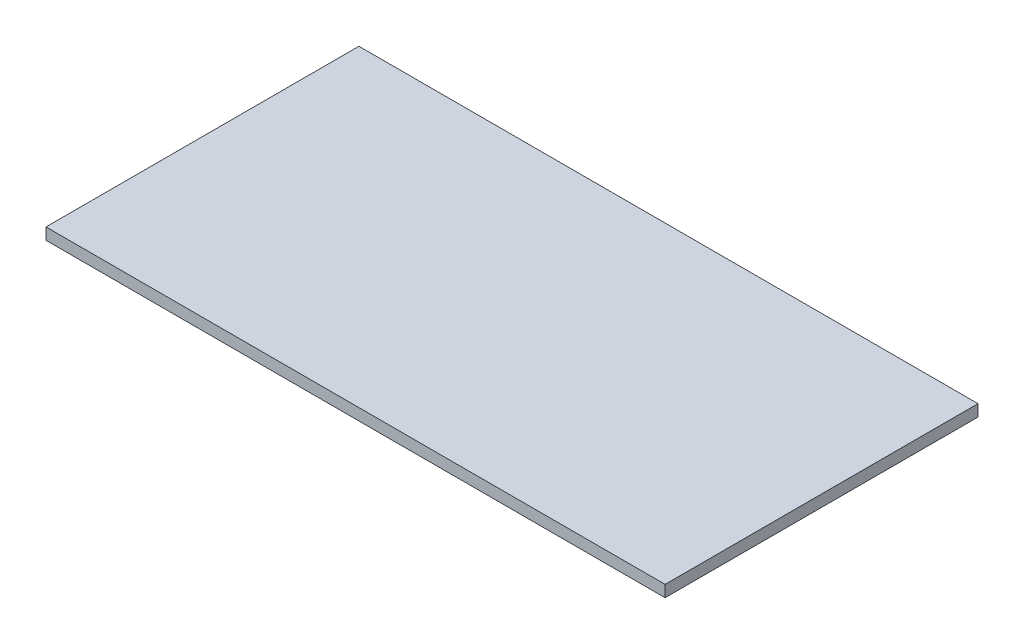
ISO-10303-21;
HEADER;
FILE_DESCRIPTION(('STEP AP214'),'2;1');
FILE_NAME('part.step','',(''),(''),'','','');
FILE_SCHEMA(('AUTOMOTIVE_DESIGN { 1 0 10303 214 1 1 1 1 }'));
ENDSEC;
DATA;
#1=APPLICATION_CONTEXT('core data for automotive mechanical design processes');
#2=APPLICATION_PROTOCOL_DEFINITION('international standard','automotive_design',2000,#1);
#3=PRODUCT_CONTEXT('',#1,'mechanical');
#4=PRODUCT('Part','Part','',(#3));
#5=PRODUCT_RELATED_PRODUCT_CATEGORY('part','',(#4));
#6=PRODUCT_DEFINITION_FORMATION('','',#4);
#7=PRODUCT_DEFINITION_CONTEXT('part definition',#1,'design');
#8=PRODUCT_DEFINITION('design','',#6,#7);
#9=PRODUCT_DEFINITION_SHAPE('','',#8);
#10=(LENGTH_UNIT() NAMED_UNIT(*) SI_UNIT(.MILLI.,.METRE.));
#11=(NAMED_UNIT(*) PLANE_ANGLE_UNIT() SI_UNIT($,.RADIAN.));
#12=(NAMED_UNIT(*) SI_UNIT($,.STERADIAN.) SOLID_ANGLE_UNIT());
#13=UNCERTAINTY_MEASURE_WITH_UNIT(LENGTH_MEASURE(1.E-05),#10,'distance_accuracy_value','');
#14=(GEOMETRIC_REPRESENTATION_CONTEXT(3) GLOBAL_UNCERTAINTY_ASSIGNED_CONTEXT((#13)) GLOBAL_UNIT_ASSIGNED_CONTEXT((#10,
#11,#12)) REPRESENTATION_CONTEXT('',''));
#15=CARTESIAN_POINT('',(0.,0.,0.));
#16=DIRECTION('',(0.,0.,1.));
#17=DIRECTION('',(1.,0.,0.));
#18=AXIS2_PLACEMENT_3D('',#15,#16,#17);
#19=CARTESIAN_POINT('',(0.,3.048,0.));
#20=DIRECTION('',(-1.,0.,0.));
#21=DIRECTION('',(0.,0.,1.));
#22=AXIS2_PLACEMENT_3D('',#19,#20,#21);
#23=PLANE('',#22);
#24=DIRECTION('',(0.,0.,-1.));
#25=VECTOR('',#24,1.);
#26=CARTESIAN_POINT('',(0.,0.,0.));
#27=LINE('',#26,#25);
#28=CARTESIAN_POINT('',(0.,0.,0.));
#29=VERTEX_POINT('',#28);
#30=CARTESIAN_POINT('',(0.,0.,-82.169));
#31=VERTEX_POINT('',#30);
#32=EDGE_CURVE('E107',#29,#31,#27,.T.);
#33=ORIENTED_EDGE('',*,*,#32,.T.);
#34=DIRECTION('',(0.,-1.,0.));
#35=VECTOR('',#34,1.);
#36=CARTESIAN_POINT('',(0.,3.048,-82.169));
#37=LINE('',#36,#35);
#38=CARTESIAN_POINT('',(0.,3.048,-82.169));
#39=VERTEX_POINT('',#38);
#40=EDGE_CURVE('E11',#39,#31,#37,.T.);
#41=ORIENTED_EDGE('',*,*,#40,.F.);
#42=DIRECTION('',(0.,0.,-1.));
#43=VECTOR('',#42,1.);
#44=CARTESIAN_POINT('',(0.,3.048,0.));
#45=LINE('',#44,#43);
#46=CARTESIAN_POINT('',(0.,3.048,0.));
#47=VERTEX_POINT('',#46);
#48=EDGE_CURVE('E91',#47,#39,#45,.T.);
#49=ORIENTED_EDGE('',*,*,#48,.F.);
#50=DIRECTION('',(0.,-1.,0.));
#51=VECTOR('',#50,1.);
#52=CARTESIAN_POINT('',(0.,3.048,0.));
#53=LINE('',#52,#51);
#54=EDGE_CURVE('E103',#47,#29,#53,.T.);
#55=ORIENTED_EDGE('',*,*,#54,.T.);
#56=EDGE_LOOP('',(#33,#41,#49,#55));
#57=FACE_BOUND('',#56,.T.);
#58=ADVANCED_FACE('F39',(#57),#23,.F.);
#59=CARTESIAN_POINT('',(0.,3.048,-82.169));
#60=DIRECTION('',(0.,0.,1.));
#61=DIRECTION('',(1.,0.,0.));
#62=AXIS2_PLACEMENT_3D('',#59,#60,#61);
#63=PLANE('',#62);
#64=DIRECTION('',(-1.,0.,0.));
#65=VECTOR('',#64,1.);
#66=CARTESIAN_POINT('',(0.,0.,-82.169));
#67=LINE('',#66,#65);
#68=CARTESIAN_POINT('',(-162.56,0.,-82.169));
#69=VERTEX_POINT('',#68);
#70=EDGE_CURVE('E96',#31,#69,#67,.T.);
#71=ORIENTED_EDGE('',*,*,#70,.T.);
#72=DIRECTION('',(0.,-1.,0.));
#73=VECTOR('',#72,1.);
#74=CARTESIAN_POINT('',(-162.56,3.048,-82.169));
#75=LINE('',#74,#73);
#76=CARTESIAN_POINT('',(-162.56,3.048,-82.169));
#77=VERTEX_POINT('',#76);
#78=EDGE_CURVE('E48',#77,#69,#75,.T.);
#79=ORIENTED_EDGE('',*,*,#78,.F.);
#80=DIRECTION('',(-1.,0.,0.));
#81=VECTOR('',#80,1.);
#82=CARTESIAN_POINT('',(0.,3.048,-82.169));
#83=LINE('',#82,#81);
#84=EDGE_CURVE('E86',#39,#77,#83,.T.);
#85=ORIENTED_EDGE('',*,*,#84,.F.);
#86=ORIENTED_EDGE('',*,*,#40,.T.);
#87=EDGE_LOOP('',(#71,#79,#85,#86));
#88=FACE_BOUND('',#87,.T.);
#89=ADVANCED_FACE('F95',(#88),#63,.F.);
#90=CARTESIAN_POINT('',(-162.56,3.048,0.));
#91=DIRECTION('',(1.,0.,0.));
#92=DIRECTION('',(0.,0.,-1.));
#93=AXIS2_PLACEMENT_3D('',#90,#91,#92);
#94=PLANE('',#93);
#95=DIRECTION('',(0.,0.,1.));
#96=VECTOR('',#95,1.);
#97=CARTESIAN_POINT('',(-162.56,0.,0.));
#98=LINE('',#97,#96);
#99=CARTESIAN_POINT('',(-162.56,0.,0.));
#100=VERTEX_POINT('',#99);
#101=EDGE_CURVE('E73',#69,#100,#98,.T.);
#102=ORIENTED_EDGE('',*,*,#101,.T.);
#103=DIRECTION('',(0.,-1.,0.));
#104=VECTOR('',#103,1.);
#105=CARTESIAN_POINT('',(-162.56,3.048,0.));
#106=LINE('',#105,#104);
#107=CARTESIAN_POINT('',(-162.56,3.048,0.));
#108=VERTEX_POINT('',#107);
#109=EDGE_CURVE('E98',#108,#100,#106,.T.);
#110=ORIENTED_EDGE('',*,*,#109,.F.);
#111=DIRECTION('',(0.,0.,1.));
#112=VECTOR('',#111,1.);
#113=CARTESIAN_POINT('',(-162.56,3.048,0.));
#114=LINE('',#113,#112);
#115=EDGE_CURVE('E89',#77,#108,#114,.T.);
#116=ORIENTED_EDGE('',*,*,#115,.F.);
#117=ORIENTED_EDGE('',*,*,#78,.T.);
#118=EDGE_LOOP('',(#102,#110,#116,#117));
#119=FACE_BOUND('',#118,.T.);
#120=ADVANCED_FACE('F99',(#119),#94,.F.);
#121=CARTESIAN_POINT('',(0.,3.048,0.));
#122=DIRECTION('',(0.,0.,-1.));
#123=DIRECTION('',(-1.,0.,0.));
#124=AXIS2_PLACEMENT_3D('',#121,#122,#123);
#125=PLANE('',#124);
#126=DIRECTION('',(1.,0.,0.));
#127=VECTOR('',#126,1.);
#128=CARTESIAN_POINT('',(0.,0.,0.));
#129=LINE('',#128,#127);
#130=EDGE_CURVE('E79',#100,#29,#129,.T.);
#131=ORIENTED_EDGE('',*,*,#130,.T.);
#132=ORIENTED_EDGE('',*,*,#54,.F.);
#133=DIRECTION('',(1.,0.,0.));
#134=VECTOR('',#133,1.);
#135=CARTESIAN_POINT('',(0.,3.048,0.));
#136=LINE('',#135,#134);
#137=EDGE_CURVE('E56',#108,#47,#136,.T.);
#138=ORIENTED_EDGE('',*,*,#137,.F.);
#139=ORIENTED_EDGE('',*,*,#109,.T.);
#140=EDGE_LOOP('',(#131,#132,#138,#139));
#141=FACE_BOUND('',#140,.T.);
#142=ADVANCED_FACE('F120',(#141),#125,.F.);
#143=CARTESIAN_POINT('',(0.,3.048,0.));
#144=DIRECTION('',(0.,1.,0.));
#145=DIRECTION('',(0.,0.,1.));
#146=AXIS2_PLACEMENT_3D('',#143,#144,#145);
#147=PLANE('',#146);
#148=ORIENTED_EDGE('',*,*,#48,.T.);
#149=ORIENTED_EDGE('',*,*,#84,.T.);
#150=ORIENTED_EDGE('',*,*,#115,.T.);
#151=ORIENTED_EDGE('',*,*,#137,.T.);
#152=EDGE_LOOP('',(#148,#149,#150,#151));
#153=FACE_BOUND('',#152,.T.);
#154=ADVANCED_FACE('F87',(#153),#147,.T.);
#155=CARTESIAN_POINT('',(0.,0.,0.));
#156=DIRECTION('',(0.,1.,0.));
#157=DIRECTION('',(0.,0.,1.));
#158=AXIS2_PLACEMENT_3D('',#155,#156,#157);
#159=PLANE('',#158);
#160=ORIENTED_EDGE('',*,*,#32,.F.);
#161=ORIENTED_EDGE('',*,*,#130,.F.);
#162=ORIENTED_EDGE('',*,*,#101,.F.);
#163=ORIENTED_EDGE('',*,*,#70,.F.);
#164=EDGE_LOOP('',(#160,#161,#162,#163));
#165=FACE_BOUND('',#164,.T.);
#166=ADVANCED_FACE('F123',(#165),#159,.F.);
#167=CLOSED_SHELL('',(#58,#89,#120,#142,#154,#166));
#168=MANIFOLD_SOLID_BREP('B2',#167);
#169=ADVANCED_BREP_SHAPE_REPRESENTATION('',(#18,#168),#14);
#170=SHAPE_DEFINITION_REPRESENTATION(#9,#169);
ENDSEC;
END-ISO-10303-21;
